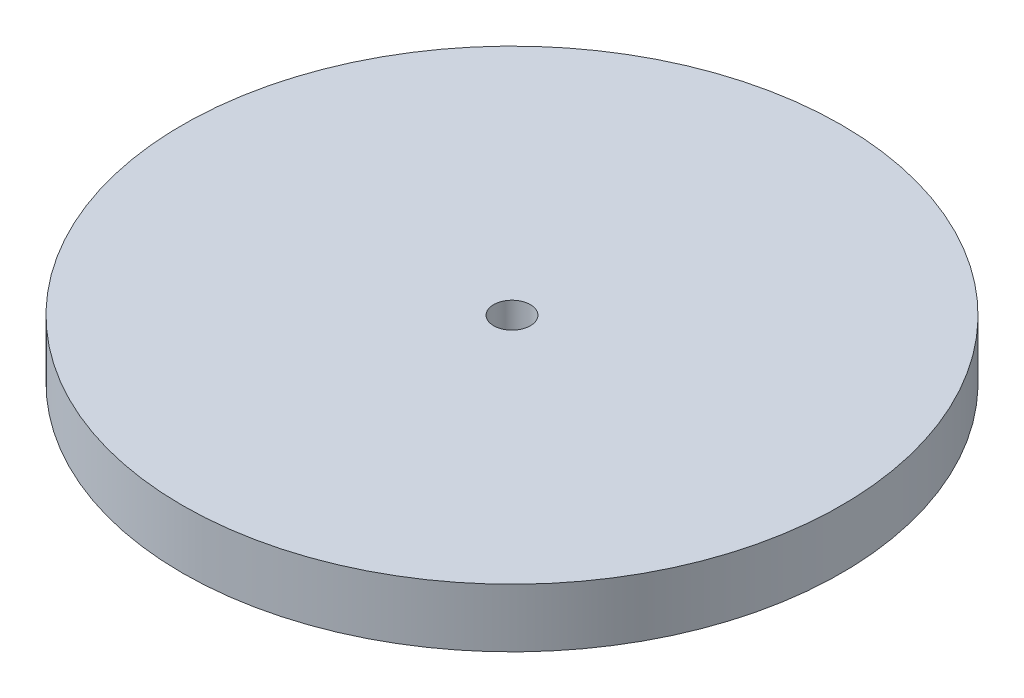
ISO-10303-21;
HEADER;
FILE_DESCRIPTION(('STEP AP214'),'2;1');
FILE_NAME('part.step','',(''),(''),'','','');
FILE_SCHEMA(('AUTOMOTIVE_DESIGN { 1 0 10303 214 1 1 1 1 }'));
ENDSEC;
DATA;
#1=APPLICATION_CONTEXT('core data for automotive mechanical design processes');
#2=APPLICATION_PROTOCOL_DEFINITION('international standard','automotive_design',2000,#1);
#3=PRODUCT_CONTEXT('',#1,'mechanical');
#4=PRODUCT('Part','Part','',(#3));
#5=PRODUCT_RELATED_PRODUCT_CATEGORY('part','',(#4));
#6=PRODUCT_DEFINITION_FORMATION('','',#4);
#7=PRODUCT_DEFINITION_CONTEXT('part definition',#1,'design');
#8=PRODUCT_DEFINITION('design','',#6,#7);
#9=PRODUCT_DEFINITION_SHAPE('','',#8);
#10=(LENGTH_UNIT() NAMED_UNIT(*) SI_UNIT(.MILLI.,.METRE.));
#11=(NAMED_UNIT(*) PLANE_ANGLE_UNIT() SI_UNIT($,.RADIAN.));
#12=(NAMED_UNIT(*) SI_UNIT($,.STERADIAN.) SOLID_ANGLE_UNIT());
#13=UNCERTAINTY_MEASURE_WITH_UNIT(LENGTH_MEASURE(1.E-05),#10,'distance_accuracy_value','');
#14=(GEOMETRIC_REPRESENTATION_CONTEXT(3) GLOBAL_UNCERTAINTY_ASSIGNED_CONTEXT((#13)) GLOBAL_UNIT_ASSIGNED_CONTEXT((#10,
#11,#12)) REPRESENTATION_CONTEXT('',''));
#15=CARTESIAN_POINT('',(0.,0.,0.));
#16=DIRECTION('',(0.,0.,1.));
#17=DIRECTION('',(1.,0.,0.));
#18=AXIS2_PLACEMENT_3D('',#15,#16,#17);
#19=CARTESIAN_POINT('',(0.,3.2,0.));
#20=DIRECTION('',(0.,-1.,0.));
#21=DIRECTION('',(0.,0.,-1.));
#22=AXIS2_PLACEMENT_3D('',#19,#20,#21);
#23=CYLINDRICAL_SURFACE('',#22,18.);
#24=CARTESIAN_POINT('',(0.,3.2,0.));
#25=DIRECTION('',(0.,1.,0.));
#26=DIRECTION('',(0.,0.,1.));
#27=AXIS2_PLACEMENT_3D('',#24,#25,#26);
#28=CIRCLE('',#27,18.);
#29=CARTESIAN_POINT('',(0.,3.2,18.));
#30=VERTEX_POINT('',#29);
#31=EDGE_CURVE('E10',#30,#30,#28,.T.);
#32=ORIENTED_EDGE('',*,*,#31,.F.);
#33=EDGE_LOOP('',(#32));
#34=FACE_BOUND('',#33,.T.);
#35=CARTESIAN_POINT('',(0.,0.,0.));
#36=DIRECTION('',(0.,1.,0.));
#37=DIRECTION('',(0.,0.,1.));
#38=AXIS2_PLACEMENT_3D('',#35,#36,#37);
#39=CIRCLE('',#38,18.);
#40=CARTESIAN_POINT('',(0.,0.,18.));
#41=VERTEX_POINT('',#40);
#42=EDGE_CURVE('E38',#41,#41,#39,.T.);
#43=ORIENTED_EDGE('',*,*,#42,.T.);
#44=EDGE_LOOP('',(#43));
#45=FACE_BOUND('',#44,.T.);
#46=ADVANCED_FACE('F35',(#34,#45),#23,.T.);
#47=CARTESIAN_POINT('',(0.,3.2,0.));
#48=DIRECTION('',(0.,1.,0.));
#49=DIRECTION('',(0.,0.,1.));
#50=AXIS2_PLACEMENT_3D('',#47,#48,#49);
#51=PLANE('',#50);
#52=CARTESIAN_POINT('',(0.,3.2,0.));
#53=DIRECTION('',(0.,1.,0.));
#54=DIRECTION('',(0.,0.,1.));
#55=AXIS2_PLACEMENT_3D('',#52,#53,#54);
#56=CIRCLE('',#55,1.0025);
#57=CARTESIAN_POINT('',(0.,3.2,1.0025));
#58=VERTEX_POINT('',#57);
#59=EDGE_CURVE('E47',#58,#58,#56,.T.);
#60=ORIENTED_EDGE('',*,*,#59,.F.);
#61=EDGE_LOOP('',(#60));
#62=FACE_BOUND('',#61,.T.);
#63=ORIENTED_EDGE('',*,*,#31,.T.);
#64=EDGE_LOOP('',(#63));
#65=FACE_BOUND('',#64,.T.);
#66=ADVANCED_FACE('F62',(#62,#65),#51,.T.);
#67=CARTESIAN_POINT('',(0.,0.,0.));
#68=DIRECTION('',(0.,1.,0.));
#69=DIRECTION('',(0.,0.,1.));
#70=AXIS2_PLACEMENT_3D('',#67,#68,#69);
#71=PLANE('',#70);
#72=CARTESIAN_POINT('',(0.,0.,0.));
#73=DIRECTION('',(0.,1.,0.));
#74=DIRECTION('',(0.,0.,1.));
#75=AXIS2_PLACEMENT_3D('',#72,#73,#74);
#76=CIRCLE('',#75,1.0025);
#77=CARTESIAN_POINT('',(0.,0.,1.0025));
#78=VERTEX_POINT('',#77);
#79=EDGE_CURVE('E45',#78,#78,#76,.T.);
#80=ORIENTED_EDGE('',*,*,#79,.T.);
#81=EDGE_LOOP('',(#80));
#82=FACE_BOUND('',#81,.T.);
#83=ORIENTED_EDGE('',*,*,#42,.F.);
#84=EDGE_LOOP('',(#83));
#85=FACE_BOUND('',#84,.T.);
#86=ADVANCED_FACE('F53',(#82,#85),#71,.F.);
#87=CARTESIAN_POINT('',(0.,0.,0.));
#88=DIRECTION('',(0.,1.,0.));
#89=DIRECTION('',(0.,0.,1.));
#90=AXIS2_PLACEMENT_3D('',#87,#88,#89);
#91=CYLINDRICAL_SURFACE('',#90,1.0025);
#92=ORIENTED_EDGE('',*,*,#79,.F.);
#93=EDGE_LOOP('',(#92));
#94=FACE_BOUND('',#93,.T.);
#95=ORIENTED_EDGE('',*,*,#59,.T.);
#96=EDGE_LOOP('',(#95));
#97=FACE_BOUND('',#96,.T.);
#98=ADVANCED_FACE('F56',(#94,#97),#91,.F.);
#99=CLOSED_SHELL('',(#46,#66,#86,#98));
#100=MANIFOLD_SOLID_BREP('B2',#99);
#101=ADVANCED_BREP_SHAPE_REPRESENTATION('',(#18,#100),#14);
#102=SHAPE_DEFINITION_REPRESENTATION(#9,#101);
ENDSEC;
END-ISO-10303-21;
